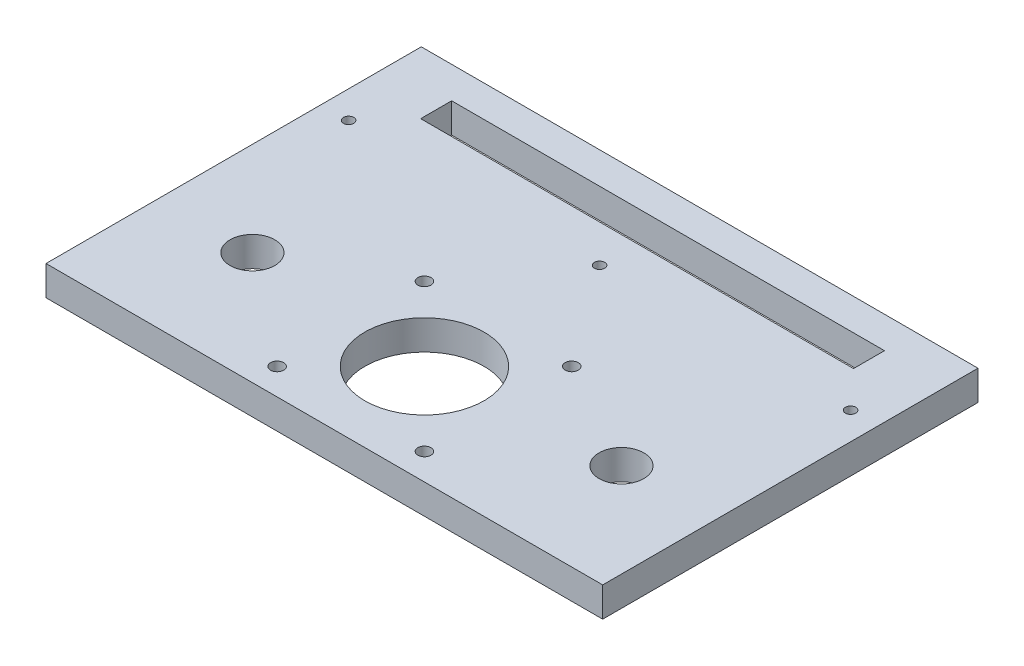
ISO-10303-21;
HEADER;
FILE_DESCRIPTION(('STEP AP214'),'2;1');
FILE_NAME('part.step','',(''),(''),'','','');
FILE_SCHEMA(('AUTOMOTIVE_DESIGN { 1 0 10303 214 1 1 1 1 }'));
ENDSEC;
DATA;
#1=APPLICATION_CONTEXT('core data for automotive mechanical design processes');
#2=APPLICATION_PROTOCOL_DEFINITION('international standard','automotive_design',2000,#1);
#3=PRODUCT_CONTEXT('',#1,'mechanical');
#4=PRODUCT('Part','Part','',(#3));
#5=PRODUCT_RELATED_PRODUCT_CATEGORY('part','',(#4));
#6=PRODUCT_DEFINITION_FORMATION('','',#4);
#7=PRODUCT_DEFINITION_CONTEXT('part definition',#1,'design');
#8=PRODUCT_DEFINITION('design','',#6,#7);
#9=PRODUCT_DEFINITION_SHAPE('','',#8);
#10=(LENGTH_UNIT() NAMED_UNIT(*) SI_UNIT(.MILLI.,.METRE.));
#11=(NAMED_UNIT(*) PLANE_ANGLE_UNIT() SI_UNIT($,.RADIAN.));
#12=(NAMED_UNIT(*) SI_UNIT($,.STERADIAN.) SOLID_ANGLE_UNIT());
#13=UNCERTAINTY_MEASURE_WITH_UNIT(LENGTH_MEASURE(1.E-05),#10,'distance_accuracy_value','');
#14=(GEOMETRIC_REPRESENTATION_CONTEXT(3) GLOBAL_UNCERTAINTY_ASSIGNED_CONTEXT((#13)) GLOBAL_UNIT_ASSIGNED_CONTEXT((#10,
#11,#12)) REPRESENTATION_CONTEXT('',''));
#15=CARTESIAN_POINT('',(0.,0.,0.));
#16=DIRECTION('',(0.,0.,1.));
#17=DIRECTION('',(1.,0.,0.));
#18=AXIS2_PLACEMENT_3D('',#15,#16,#17);
#19=CARTESIAN_POINT('',(0.,9.5,0.));
#20=DIRECTION('',(0.,1.,0.));
#21=DIRECTION('',(0.,0.,1.));
#22=AXIS2_PLACEMENT_3D('',#19,#20,#21);
#23=PLANE('',#22);
#24=CARTESIAN_POINT('',(-23.55,9.5,4.45));
#25=DIRECTION('',(0.,1.,0.));
#26=DIRECTION('',(0.,0.,1.));
#27=AXIS2_PLACEMENT_3D('',#24,#25,#26);
#28=CIRCLE('',#27,2.1);
#29=CARTESIAN_POINT('',(-23.55,9.5,6.55));
#30=VERTEX_POINT('',#29);
#31=EDGE_CURVE('E297',#30,#30,#28,.T.);
#32=ORIENTED_EDGE('',*,*,#31,.F.);
#33=EDGE_LOOP('',(#32));
#34=FACE_BOUND('',#33,.T.);
#35=CARTESIAN_POINT('',(23.55,9.5,4.45));
#36=DIRECTION('',(0.,1.,0.));
#37=DIRECTION('',(0.,0.,1.));
#38=AXIS2_PLACEMENT_3D('',#35,#36,#37);
#39=CIRCLE('',#38,2.1);
#40=CARTESIAN_POINT('',(23.55,9.5,6.55));
#41=VERTEX_POINT('',#40);
#42=EDGE_CURVE('E301',#41,#41,#39,.T.);
#43=ORIENTED_EDGE('',*,*,#42,.F.);
#44=EDGE_LOOP('',(#43));
#45=FACE_BOUND('',#44,.T.);
#46=CARTESIAN_POINT('',(23.5500000000005,9.5,51.55));
#47=DIRECTION('',(0.,1.,0.));
#48=DIRECTION('',(0.,0.,1.));
#49=AXIS2_PLACEMENT_3D('',#46,#47,#48);
#50=CIRCLE('',#49,2.1);
#51=CARTESIAN_POINT('',(23.5500000000005,9.5,53.65));
#52=VERTEX_POINT('',#51);
#53=EDGE_CURVE('E311',#52,#52,#50,.T.);
#54=ORIENTED_EDGE('',*,*,#53,.F.);
#55=EDGE_LOOP('',(#54));
#56=FACE_BOUND('',#55,.T.);
#57=CARTESIAN_POINT('',(-23.5499999999995,9.5,51.55));
#58=DIRECTION('',(0.,1.,0.));
#59=DIRECTION('',(0.,0.,1.));
#60=AXIS2_PLACEMENT_3D('',#57,#58,#59);
#61=CIRCLE('',#60,2.1);
#62=CARTESIAN_POINT('',(-23.5499999999995,9.5,53.65));
#63=VERTEX_POINT('',#62);
#64=EDGE_CURVE('E319',#63,#63,#61,.T.);
#65=ORIENTED_EDGE('',*,*,#64,.F.);
#66=EDGE_LOOP('',(#65));
#67=FACE_BOUND('',#66,.T.);
#68=CARTESIAN_POINT('',(-80.25,9.5,-28.));
#69=DIRECTION('',(0.,1.,0.));
#70=DIRECTION('',(0.,0.,1.));
#71=AXIS2_PLACEMENT_3D('',#68,#69,#70);
#72=CIRCLE('',#71,1.64999999999998);
#73=CARTESIAN_POINT('',(-80.25,9.5,-26.35));
#74=VERTEX_POINT('',#73);
#75=EDGE_CURVE('E327',#74,#74,#72,.T.);
#76=ORIENTED_EDGE('',*,*,#75,.F.);
#77=EDGE_LOOP('',(#76));
#78=FACE_BOUND('',#77,.T.);
#79=CARTESIAN_POINT('',(0.,9.5,-28.));
#80=DIRECTION('',(0.,1.,0.));
#81=DIRECTION('',(0.,0.,1.));
#82=AXIS2_PLACEMENT_3D('',#79,#80,#81);
#83=CIRCLE('',#82,1.64999999999999);
#84=CARTESIAN_POINT('',(0.,9.5,-26.35));
#85=VERTEX_POINT('',#84);
#86=EDGE_CURVE('E335',#85,#85,#83,.T.);
#87=ORIENTED_EDGE('',*,*,#86,.F.);
#88=EDGE_LOOP('',(#87));
#89=FACE_BOUND('',#88,.T.);
#90=CARTESIAN_POINT('',(80.25,9.5,-28.));
#91=DIRECTION('',(0.,1.,0.));
#92=DIRECTION('',(0.,0.,1.));
#93=AXIS2_PLACEMENT_3D('',#90,#91,#92);
#94=CIRCLE('',#93,1.64999999999998);
#95=CARTESIAN_POINT('',(80.25,9.5,-26.3500000000001));
#96=VERTEX_POINT('',#95);
#97=EDGE_CURVE('E343',#96,#96,#94,.T.);
#98=ORIENTED_EDGE('',*,*,#97,.F.);
#99=EDGE_LOOP('',(#98));
#100=FACE_BOUND('',#99,.T.);
#101=CARTESIAN_POINT('',(-59.,9.5,24.));
#102=DIRECTION('',(0.,1.,0.));
#103=DIRECTION('',(0.,0.,1.));
#104=AXIS2_PLACEMENT_3D('',#101,#102,#103);
#105=CIRCLE('',#104,7.15);
#106=CARTESIAN_POINT('',(-59.,9.5,31.15));
#107=VERTEX_POINT('',#106);
#108=EDGE_CURVE('E360',#107,#107,#105,.T.);
#109=ORIENTED_EDGE('',*,*,#108,.F.);
#110=EDGE_LOOP('',(#109));
#111=FACE_BOUND('',#110,.T.);
#112=DIRECTION('',(0.,0.,1.));
#113=VECTOR('',#112,1.);
#114=CARTESIAN_POINT('',(-69.2,9.5,-49.9));
#115=LINE('',#114,#113);
#116=CARTESIAN_POINT('',(-69.2,9.5,-49.9));
#117=VERTEX_POINT('',#116);
#118=CARTESIAN_POINT('',(-69.2,9.5,-40.));
#119=VERTEX_POINT('',#118);
#120=EDGE_CURVE('E118',#117,#119,#115,.T.);
#121=ORIENTED_EDGE('',*,*,#120,.F.);
#122=DIRECTION('',(-1.,0.,0.));
#123=VECTOR('',#122,1.);
#124=CARTESIAN_POINT('',(69.2,9.5,-49.9));
#125=LINE('',#124,#123);
#126=CARTESIAN_POINT('',(69.2,9.5,-49.9));
#127=VERTEX_POINT('',#126);
#128=EDGE_CURVE('E109',#127,#117,#125,.T.);
#129=ORIENTED_EDGE('',*,*,#128,.F.);
#130=DIRECTION('',(0.,0.,-1.));
#131=VECTOR('',#130,1.);
#132=CARTESIAN_POINT('',(69.2,9.5,-40.));
#133=LINE('',#132,#131);
#134=CARTESIAN_POINT('',(69.2,9.5,-40.));
#135=VERTEX_POINT('',#134);
#136=EDGE_CURVE('E136',#135,#127,#133,.T.);
#137=ORIENTED_EDGE('',*,*,#136,.F.);
#138=DIRECTION('',(1.,0.,0.));
#139=VECTOR('',#138,1.);
#140=CARTESIAN_POINT('',(-69.2,9.5,-40.));
#141=LINE('',#140,#139);
#142=EDGE_CURVE('E132',#119,#135,#141,.T.);
#143=ORIENTED_EDGE('',*,*,#142,.F.);
#144=EDGE_LOOP('',(#121,#129,#137,#143));
#145=FACE_BOUND('',#144,.T.);
#146=DIRECTION('',(0.,0.,-1.));
#147=VECTOR('',#146,1.);
#148=CARTESIAN_POINT('',(89.,9.5,-60.));
#149=LINE('',#148,#147);
#150=CARTESIAN_POINT('',(89.,9.5,60.));
#151=VERTEX_POINT('',#150);
#152=CARTESIAN_POINT('',(89.,9.5,-60.));
#153=VERTEX_POINT('',#152);
#154=EDGE_CURVE('E160',#151,#153,#149,.T.);
#155=ORIENTED_EDGE('',*,*,#154,.T.);
#156=DIRECTION('',(-1.,0.,0.));
#157=VECTOR('',#156,1.);
#158=CARTESIAN_POINT('',(-89.,9.5,-60.));
#159=LINE('',#158,#157);
#160=CARTESIAN_POINT('',(-89.,9.5,-60.));
#161=VERTEX_POINT('',#160);
#162=EDGE_CURVE('E164',#153,#161,#159,.T.);
#163=ORIENTED_EDGE('',*,*,#162,.T.);
#164=DIRECTION('',(0.,0.,1.));
#165=VECTOR('',#164,1.);
#166=CARTESIAN_POINT('',(-89.,9.5,-60.));
#167=LINE('',#166,#165);
#168=CARTESIAN_POINT('',(-89.,9.5,60.));
#169=VERTEX_POINT('',#168);
#170=EDGE_CURVE('E168',#161,#169,#167,.T.);
#171=ORIENTED_EDGE('',*,*,#170,.T.);
#172=DIRECTION('',(1.,0.,0.));
#173=VECTOR('',#172,1.);
#174=CARTESIAN_POINT('',(-89.,9.5,60.));
#175=LINE('',#174,#173);
#176=EDGE_CURVE('E171',#169,#151,#175,.T.);
#177=ORIENTED_EDGE('',*,*,#176,.T.);
#178=EDGE_LOOP('',(#155,#163,#171,#177));
#179=FACE_BOUND('',#178,.T.);
#180=CARTESIAN_POINT('',(0.,9.5,28.));
#181=DIRECTION('',(0.,1.,0.));
#182=DIRECTION('',(0.,0.,1.));
#183=AXIS2_PLACEMENT_3D('',#180,#181,#182);
#184=CIRCLE('',#183,19.0500000000001);
#185=CARTESIAN_POINT('',(0.,9.5,47.0500000000001));
#186=VERTEX_POINT('',#185);
#187=EDGE_CURVE('E144',#186,#186,#184,.T.);
#188=ORIENTED_EDGE('',*,*,#187,.F.);
#189=EDGE_LOOP('',(#188));
#190=FACE_BOUND('',#189,.T.);
#191=CARTESIAN_POINT('',(59.,9.5,24.));
#192=DIRECTION('',(0.,1.,0.));
#193=DIRECTION('',(0.,0.,-1.));
#194=AXIS2_PLACEMENT_3D('',#191,#192,#193);
#195=CIRCLE('',#194,7.15);
#196=CARTESIAN_POINT('',(59.,9.5,16.85));
#197=VERTEX_POINT('',#196);
#198=EDGE_CURVE('E352',#197,#197,#195,.T.);
#199=ORIENTED_EDGE('',*,*,#198,.F.);
#200=EDGE_LOOP('',(#199));
#201=FACE_BOUND('',#200,.T.);
#202=ADVANCED_FACE('F43',(#34,#45,#56,#67,#78,#89,#100,#111,#145,#179,#190,#201),#23,.T.);
#203=CARTESIAN_POINT('',(0.,0.,0.));
#204=DIRECTION('',(0.,1.,0.));
#205=DIRECTION('',(0.,0.,1.));
#206=AXIS2_PLACEMENT_3D('',#203,#204,#205);
#207=PLANE('',#206);
#208=CARTESIAN_POINT('',(-23.55,0.,4.45));
#209=DIRECTION('',(0.,1.,0.));
#210=DIRECTION('',(0.,0.,1.));
#211=AXIS2_PLACEMENT_3D('',#208,#209,#210);
#212=CIRCLE('',#211,2.1);
#213=CARTESIAN_POINT('',(-23.55,0.,6.55));
#214=VERTEX_POINT('',#213);
#215=EDGE_CURVE('E295',#214,#214,#212,.T.);
#216=ORIENTED_EDGE('',*,*,#215,.T.);
#217=EDGE_LOOP('',(#216));
#218=FACE_BOUND('',#217,.T.);
#219=CARTESIAN_POINT('',(23.55,0.,4.45));
#220=DIRECTION('',(0.,1.,0.));
#221=DIRECTION('',(0.,0.,1.));
#222=AXIS2_PLACEMENT_3D('',#219,#220,#221);
#223=CIRCLE('',#222,2.1);
#224=CARTESIAN_POINT('',(23.55,0.,6.55));
#225=VERTEX_POINT('',#224);
#226=EDGE_CURVE('E307',#225,#225,#223,.T.);
#227=ORIENTED_EDGE('',*,*,#226,.T.);
#228=EDGE_LOOP('',(#227));
#229=FACE_BOUND('',#228,.T.);
#230=CARTESIAN_POINT('',(23.5500000000005,0.,51.55));
#231=DIRECTION('',(0.,1.,0.));
#232=DIRECTION('',(0.,0.,1.));
#233=AXIS2_PLACEMENT_3D('',#230,#231,#232);
#234=CIRCLE('',#233,2.1);
#235=CARTESIAN_POINT('',(23.5500000000005,0.,53.65));
#236=VERTEX_POINT('',#235);
#237=EDGE_CURVE('E315',#236,#236,#234,.T.);
#238=ORIENTED_EDGE('',*,*,#237,.T.);
#239=EDGE_LOOP('',(#238));
#240=FACE_BOUND('',#239,.T.);
#241=CARTESIAN_POINT('',(-23.5499999999995,0.,51.55));
#242=DIRECTION('',(0.,1.,0.));
#243=DIRECTION('',(0.,0.,1.));
#244=AXIS2_PLACEMENT_3D('',#241,#242,#243);
#245=CIRCLE('',#244,2.1);
#246=CARTESIAN_POINT('',(-23.5499999999995,0.,53.65));
#247=VERTEX_POINT('',#246);
#248=EDGE_CURVE('E323',#247,#247,#245,.T.);
#249=ORIENTED_EDGE('',*,*,#248,.T.);
#250=EDGE_LOOP('',(#249));
#251=FACE_BOUND('',#250,.T.);
#252=CARTESIAN_POINT('',(-80.25,0.,-28.));
#253=DIRECTION('',(0.,1.,0.));
#254=DIRECTION('',(0.,0.,1.));
#255=AXIS2_PLACEMENT_3D('',#252,#253,#254);
#256=CIRCLE('',#255,1.65);
#257=CARTESIAN_POINT('',(-80.25,0.,-26.35));
#258=VERTEX_POINT('',#257);
#259=EDGE_CURVE('E331',#258,#258,#256,.T.);
#260=ORIENTED_EDGE('',*,*,#259,.T.);
#261=EDGE_LOOP('',(#260));
#262=FACE_BOUND('',#261,.T.);
#263=CARTESIAN_POINT('',(0.,0.,-28.));
#264=DIRECTION('',(0.,1.,0.));
#265=DIRECTION('',(0.,0.,1.));
#266=AXIS2_PLACEMENT_3D('',#263,#264,#265);
#267=CIRCLE('',#266,1.65);
#268=CARTESIAN_POINT('',(0.,0.,-26.35));
#269=VERTEX_POINT('',#268);
#270=EDGE_CURVE('E339',#269,#269,#267,.T.);
#271=ORIENTED_EDGE('',*,*,#270,.T.);
#272=EDGE_LOOP('',(#271));
#273=FACE_BOUND('',#272,.T.);
#274=CARTESIAN_POINT('',(80.25,0.,-28.));
#275=DIRECTION('',(0.,1.,0.));
#276=DIRECTION('',(0.,0.,1.));
#277=AXIS2_PLACEMENT_3D('',#274,#275,#276);
#278=CIRCLE('',#277,1.65);
#279=CARTESIAN_POINT('',(80.25,0.,-26.35));
#280=VERTEX_POINT('',#279);
#281=EDGE_CURVE('E347',#280,#280,#278,.T.);
#282=ORIENTED_EDGE('',*,*,#281,.T.);
#283=EDGE_LOOP('',(#282));
#284=FACE_BOUND('',#283,.T.);
#285=DIRECTION('',(0.,0.,-1.));
#286=VECTOR('',#285,1.);
#287=CARTESIAN_POINT('',(89.,0.,-60.));
#288=LINE('',#287,#286);
#289=CARTESIAN_POINT('',(89.,0.,60.));
#290=VERTEX_POINT('',#289);
#291=CARTESIAN_POINT('',(89.,0.,-60.));
#292=VERTEX_POINT('',#291);
#293=EDGE_CURVE('E127',#290,#292,#288,.T.);
#294=ORIENTED_EDGE('',*,*,#293,.F.);
#295=DIRECTION('',(1.,0.,0.));
#296=VECTOR('',#295,1.);
#297=CARTESIAN_POINT('',(-89.,0.,60.));
#298=LINE('',#297,#296);
#299=CARTESIAN_POINT('',(-89.,0.,60.));
#300=VERTEX_POINT('',#299);
#301=EDGE_CURVE('E165',#300,#290,#298,.T.);
#302=ORIENTED_EDGE('',*,*,#301,.F.);
#303=DIRECTION('',(0.,0.,1.));
#304=VECTOR('',#303,1.);
#305=CARTESIAN_POINT('',(-89.,0.,-60.));
#306=LINE('',#305,#304);
#307=CARTESIAN_POINT('',(-89.,0.,-60.));
#308=VERTEX_POINT('',#307);
#309=EDGE_CURVE('E181',#308,#300,#306,.T.);
#310=ORIENTED_EDGE('',*,*,#309,.F.);
#311=DIRECTION('',(-1.,0.,0.));
#312=VECTOR('',#311,1.);
#313=CARTESIAN_POINT('',(-89.,0.,-60.));
#314=LINE('',#313,#312);
#315=EDGE_CURVE('E178',#292,#308,#314,.T.);
#316=ORIENTED_EDGE('',*,*,#315,.F.);
#317=EDGE_LOOP('',(#294,#302,#310,#316));
#318=FACE_BOUND('',#317,.T.);
#319=DIRECTION('',(-1.,0.,0.));
#320=VECTOR('',#319,1.);
#321=CARTESIAN_POINT('',(69.2,0.,-49.9));
#322=LINE('',#321,#320);
#323=CARTESIAN_POINT('',(69.2,0.,-49.9));
#324=VERTEX_POINT('',#323);
#325=CARTESIAN_POINT('',(-69.2,0.,-49.9));
#326=VERTEX_POINT('',#325);
#327=EDGE_CURVE('E67',#324,#326,#322,.T.);
#328=ORIENTED_EDGE('',*,*,#327,.T.);
#329=DIRECTION('',(0.,0.,1.));
#330=VECTOR('',#329,1.);
#331=CARTESIAN_POINT('',(-69.2,0.,-49.9));
#332=LINE('',#331,#330);
#333=CARTESIAN_POINT('',(-69.2,0.,-40.));
#334=VERTEX_POINT('',#333);
#335=EDGE_CURVE('E125',#326,#334,#332,.T.);
#336=ORIENTED_EDGE('',*,*,#335,.T.);
#337=DIRECTION('',(1.,0.,0.));
#338=VECTOR('',#337,1.);
#339=CARTESIAN_POINT('',(-69.2,0.,-40.));
#340=LINE('',#339,#338);
#341=CARTESIAN_POINT('',(69.2,0.,-40.));
#342=VERTEX_POINT('',#341);
#343=EDGE_CURVE('E147',#334,#342,#340,.T.);
#344=ORIENTED_EDGE('',*,*,#343,.T.);
#345=DIRECTION('',(0.,0.,-1.));
#346=VECTOR('',#345,1.);
#347=CARTESIAN_POINT('',(69.2,0.,-40.));
#348=LINE('',#347,#346);
#349=EDGE_CURVE('E119',#342,#324,#348,.T.);
#350=ORIENTED_EDGE('',*,*,#349,.T.);
#351=EDGE_LOOP('',(#328,#336,#344,#350));
#352=FACE_BOUND('',#351,.T.);
#353=CARTESIAN_POINT('',(0.,0.,28.));
#354=DIRECTION('',(0.,1.,0.));
#355=DIRECTION('',(0.,0.,1.));
#356=AXIS2_PLACEMENT_3D('',#353,#354,#355);
#357=CIRCLE('',#356,19.0500000000001);
#358=CARTESIAN_POINT('',(0.,0.,47.0500000000001));
#359=VERTEX_POINT('',#358);
#360=EDGE_CURVE('E364',#359,#359,#357,.T.);
#361=ORIENTED_EDGE('',*,*,#360,.T.);
#362=EDGE_LOOP('',(#361));
#363=FACE_BOUND('',#362,.T.);
#364=CARTESIAN_POINT('',(-59.,0.,24.));
#365=DIRECTION('',(0.,1.,0.));
#366=DIRECTION('',(0.,0.,1.));
#367=AXIS2_PLACEMENT_3D('',#364,#365,#366);
#368=CIRCLE('',#367,7.15);
#369=CARTESIAN_POINT('',(-59.,0.,31.15));
#370=VERTEX_POINT('',#369);
#371=EDGE_CURVE('E356',#370,#370,#368,.T.);
#372=ORIENTED_EDGE('',*,*,#371,.T.);
#373=EDGE_LOOP('',(#372));
#374=FACE_BOUND('',#373,.T.);
#375=CARTESIAN_POINT('',(59.,0.,24.));
#376=DIRECTION('',(0.,1.,0.));
#377=DIRECTION('',(0.,0.,-1.));
#378=AXIS2_PLACEMENT_3D('',#375,#376,#377);
#379=CIRCLE('',#378,7.15);
#380=CARTESIAN_POINT('',(59.,0.,16.85));
#381=VERTEX_POINT('',#380);
#382=EDGE_CURVE('E351',#381,#381,#379,.T.);
#383=ORIENTED_EDGE('',*,*,#382,.T.);
#384=EDGE_LOOP('',(#383));
#385=FACE_BOUND('',#384,.T.);
#386=ADVANCED_FACE('F204',(#218,#229,#240,#251,#262,#273,#284,#318,#352,#363,#374,#385),#207,.F.);
#387=CARTESIAN_POINT('',(89.,9.5,-60.));
#388=DIRECTION('',(-1.,0.,0.));
#389=DIRECTION('',(0.,0.,1.));
#390=AXIS2_PLACEMENT_3D('',#387,#388,#389);
#391=PLANE('',#390);
#392=ORIENTED_EDGE('',*,*,#293,.T.);
#393=DIRECTION('',(0.,-1.,0.));
#394=VECTOR('',#393,1.);
#395=CARTESIAN_POINT('',(89.,9.5,-60.));
#396=LINE('',#395,#394);
#397=EDGE_CURVE('E11',#153,#292,#396,.T.);
#398=ORIENTED_EDGE('',*,*,#397,.F.);
#399=ORIENTED_EDGE('',*,*,#154,.F.);
#400=DIRECTION('',(0.,-1.,0.));
#401=VECTOR('',#400,1.);
#402=CARTESIAN_POINT('',(89.,9.5,60.));
#403=LINE('',#402,#401);
#404=EDGE_CURVE('E174',#151,#290,#403,.T.);
#405=ORIENTED_EDGE('',*,*,#404,.T.);
#406=EDGE_LOOP('',(#392,#398,#399,#405));
#407=FACE_BOUND('',#406,.T.);
#408=ADVANCED_FACE('F45',(#407),#391,.F.);
#409=CARTESIAN_POINT('',(-89.,9.5,-60.));
#410=DIRECTION('',(0.,0.,1.));
#411=DIRECTION('',(1.,0.,0.));
#412=AXIS2_PLACEMENT_3D('',#409,#410,#411);
#413=PLANE('',#412);
#414=ORIENTED_EDGE('',*,*,#315,.T.);
#415=DIRECTION('',(0.,-1.,0.));
#416=VECTOR('',#415,1.);
#417=CARTESIAN_POINT('',(-89.,9.5,-60.));
#418=LINE('',#417,#416);
#419=EDGE_CURVE('E52',#161,#308,#418,.T.);
#420=ORIENTED_EDGE('',*,*,#419,.F.);
#421=ORIENTED_EDGE('',*,*,#162,.F.);
#422=ORIENTED_EDGE('',*,*,#397,.T.);
#423=EDGE_LOOP('',(#414,#420,#421,#422));
#424=FACE_BOUND('',#423,.T.);
#425=ADVANCED_FACE('F214',(#424),#413,.F.);
#426=CARTESIAN_POINT('',(-89.,9.5,-60.));
#427=DIRECTION('',(1.,0.,0.));
#428=DIRECTION('',(0.,0.,-1.));
#429=AXIS2_PLACEMENT_3D('',#426,#427,#428);
#430=PLANE('',#429);
#431=ORIENTED_EDGE('',*,*,#309,.T.);
#432=DIRECTION('',(0.,-1.,0.));
#433=VECTOR('',#432,1.);
#434=CARTESIAN_POINT('',(-89.,9.5,60.));
#435=LINE('',#434,#433);
#436=EDGE_CURVE('E189',#169,#300,#435,.T.);
#437=ORIENTED_EDGE('',*,*,#436,.F.);
#438=ORIENTED_EDGE('',*,*,#170,.F.);
#439=ORIENTED_EDGE('',*,*,#419,.T.);
#440=EDGE_LOOP('',(#431,#437,#438,#439));
#441=FACE_BOUND('',#440,.T.);
#442=ADVANCED_FACE('F198',(#441),#430,.F.);
#443=CARTESIAN_POINT('',(-89.,9.5,60.));
#444=DIRECTION('',(0.,0.,-1.));
#445=DIRECTION('',(-1.,0.,0.));
#446=AXIS2_PLACEMENT_3D('',#443,#444,#445);
#447=PLANE('',#446);
#448=ORIENTED_EDGE('',*,*,#301,.T.);
#449=ORIENTED_EDGE('',*,*,#404,.F.);
#450=ORIENTED_EDGE('',*,*,#176,.F.);
#451=ORIENTED_EDGE('',*,*,#436,.T.);
#452=EDGE_LOOP('',(#448,#449,#450,#451));
#453=FACE_BOUND('',#452,.T.);
#454=ADVANCED_FACE('F208',(#453),#447,.F.);
#455=CARTESIAN_POINT('',(69.2,9.5,-49.9));
#456=DIRECTION('',(0.,0.,1.));
#457=DIRECTION('',(1.,0.,0.));
#458=AXIS2_PLACEMENT_3D('',#455,#456,#457);
#459=PLANE('',#458);
#460=ORIENTED_EDGE('',*,*,#327,.F.);
#461=DIRECTION('',(0.,-1.,0.));
#462=VECTOR('',#461,1.);
#463=CARTESIAN_POINT('',(69.2,9.5,-49.9));
#464=LINE('',#463,#462);
#465=EDGE_CURVE('E113',#127,#324,#464,.T.);
#466=ORIENTED_EDGE('',*,*,#465,.F.);
#467=ORIENTED_EDGE('',*,*,#128,.T.);
#468=DIRECTION('',(0.,-1.,0.));
#469=VECTOR('',#468,1.);
#470=CARTESIAN_POINT('',(-69.2,9.5,-49.9));
#471=LINE('',#470,#469);
#472=EDGE_CURVE('E112',#117,#326,#471,.T.);
#473=ORIENTED_EDGE('',*,*,#472,.T.);
#474=EDGE_LOOP('',(#460,#466,#467,#473));
#475=FACE_BOUND('',#474,.T.);
#476=ADVANCED_FACE('F111',(#475),#459,.T.);
#477=CARTESIAN_POINT('',(-69.2,9.5,-49.9));
#478=DIRECTION('',(1.,0.,0.));
#479=DIRECTION('',(0.,0.,-1.));
#480=AXIS2_PLACEMENT_3D('',#477,#478,#479);
#481=PLANE('',#480);
#482=ORIENTED_EDGE('',*,*,#335,.F.);
#483=ORIENTED_EDGE('',*,*,#472,.F.);
#484=ORIENTED_EDGE('',*,*,#120,.T.);
#485=DIRECTION('',(0.,-1.,0.));
#486=VECTOR('',#485,1.);
#487=CARTESIAN_POINT('',(-69.2,9.5,-40.));
#488=LINE('',#487,#486);
#489=EDGE_CURVE('E128',#119,#334,#488,.T.);
#490=ORIENTED_EDGE('',*,*,#489,.T.);
#491=EDGE_LOOP('',(#482,#483,#484,#490));
#492=FACE_BOUND('',#491,.T.);
#493=ADVANCED_FACE('F122',(#492),#481,.T.);
#494=CARTESIAN_POINT('',(-69.2,9.5,-40.));
#495=DIRECTION('',(0.,0.,-1.));
#496=DIRECTION('',(-1.,0.,0.));
#497=AXIS2_PLACEMENT_3D('',#494,#495,#496);
#498=PLANE('',#497);
#499=ORIENTED_EDGE('',*,*,#343,.F.);
#500=ORIENTED_EDGE('',*,*,#489,.F.);
#501=ORIENTED_EDGE('',*,*,#142,.T.);
#502=DIRECTION('',(0.,-1.,0.));
#503=VECTOR('',#502,1.);
#504=CARTESIAN_POINT('',(69.2,9.5,-40.));
#505=LINE('',#504,#503);
#506=EDGE_CURVE('E59',#135,#342,#505,.T.);
#507=ORIENTED_EDGE('',*,*,#506,.T.);
#508=EDGE_LOOP('',(#499,#500,#501,#507));
#509=FACE_BOUND('',#508,.T.);
#510=ADVANCED_FACE('F241',(#509),#498,.T.);
#511=CARTESIAN_POINT('',(69.2,9.5,-40.));
#512=DIRECTION('',(-1.,0.,0.));
#513=DIRECTION('',(0.,0.,1.));
#514=AXIS2_PLACEMENT_3D('',#511,#512,#513);
#515=PLANE('',#514);
#516=ORIENTED_EDGE('',*,*,#349,.F.);
#517=ORIENTED_EDGE('',*,*,#506,.F.);
#518=ORIENTED_EDGE('',*,*,#136,.T.);
#519=ORIENTED_EDGE('',*,*,#465,.T.);
#520=EDGE_LOOP('',(#516,#517,#518,#519));
#521=FACE_BOUND('',#520,.T.);
#522=ADVANCED_FACE('F245',(#521),#515,.T.);
#523=CARTESIAN_POINT('',(0.,9.5,28.));
#524=DIRECTION('',(0.,-1.,0.));
#525=DIRECTION('',(0.,0.,-1.));
#526=AXIS2_PLACEMENT_3D('',#523,#524,#525);
#527=CYLINDRICAL_SURFACE('',#526,19.0500000000001);
#528=ORIENTED_EDGE('',*,*,#187,.T.);
#529=EDGE_LOOP('',(#528));
#530=FACE_BOUND('',#529,.T.);
#531=ORIENTED_EDGE('',*,*,#360,.F.);
#532=EDGE_LOOP('',(#531));
#533=FACE_BOUND('',#532,.T.);
#534=ADVANCED_FACE('F251',(#530,#533),#527,.F.);
#535=CARTESIAN_POINT('',(-59.,9.5,24.));
#536=DIRECTION('',(0.,-1.,0.));
#537=DIRECTION('',(0.,0.,-1.));
#538=AXIS2_PLACEMENT_3D('',#535,#536,#537);
#539=CYLINDRICAL_SURFACE('',#538,7.15);
#540=ORIENTED_EDGE('',*,*,#108,.T.);
#541=EDGE_LOOP('',(#540));
#542=FACE_BOUND('',#541,.T.);
#543=ORIENTED_EDGE('',*,*,#371,.F.);
#544=EDGE_LOOP('',(#543));
#545=FACE_BOUND('',#544,.T.);
#546=ADVANCED_FACE('F254',(#542,#545),#539,.F.);
#547=CARTESIAN_POINT('',(59.,9.5,24.));
#548=DIRECTION('',(0.,-1.,0.));
#549=DIRECTION('',(0.,0.,-1.));
#550=AXIS2_PLACEMENT_3D('',#547,#548,#549);
#551=CYLINDRICAL_SURFACE('',#550,7.15);
#552=ORIENTED_EDGE('',*,*,#198,.T.);
#553=EDGE_LOOP('',(#552));
#554=FACE_BOUND('',#553,.T.);
#555=ORIENTED_EDGE('',*,*,#382,.F.);
#556=EDGE_LOOP('',(#555));
#557=FACE_BOUND('',#556,.T.);
#558=ADVANCED_FACE('F258',(#554,#557),#551,.F.);
#559=CARTESIAN_POINT('',(80.25,9.5,-28.));
#560=DIRECTION('',(0.,1.,0.));
#561=DIRECTION('',(0.,0.,1.));
#562=AXIS2_PLACEMENT_3D('',#559,#560,#561);
#563=CYLINDRICAL_SURFACE('',#562,1.64999999999999);
#564=ORIENTED_EDGE('',*,*,#281,.F.);
#565=EDGE_LOOP('',(#564));
#566=FACE_BOUND('',#565,.T.);
#567=ORIENTED_EDGE('',*,*,#97,.T.);
#568=EDGE_LOOP('',(#567));
#569=FACE_BOUND('',#568,.T.);
#570=ADVANCED_FACE('F262',(#566,#569),#563,.F.);
#571=CARTESIAN_POINT('',(0.,9.5,-28.));
#572=DIRECTION('',(0.,1.,0.));
#573=DIRECTION('',(0.,0.,1.));
#574=AXIS2_PLACEMENT_3D('',#571,#572,#573);
#575=CYLINDRICAL_SURFACE('',#574,1.64999999999999);
#576=ORIENTED_EDGE('',*,*,#270,.F.);
#577=EDGE_LOOP('',(#576));
#578=FACE_BOUND('',#577,.T.);
#579=ORIENTED_EDGE('',*,*,#86,.T.);
#580=EDGE_LOOP('',(#579));
#581=FACE_BOUND('',#580,.T.);
#582=ADVANCED_FACE('F266',(#578,#581),#575,.F.);
#583=CARTESIAN_POINT('',(-80.25,9.5,-28.));
#584=DIRECTION('',(0.,1.,0.));
#585=DIRECTION('',(0.,0.,1.));
#586=AXIS2_PLACEMENT_3D('',#583,#584,#585);
#587=CYLINDRICAL_SURFACE('',#586,1.64999999999999);
#588=ORIENTED_EDGE('',*,*,#259,.F.);
#589=EDGE_LOOP('',(#588));
#590=FACE_BOUND('',#589,.T.);
#591=ORIENTED_EDGE('',*,*,#75,.T.);
#592=EDGE_LOOP('',(#591));
#593=FACE_BOUND('',#592,.T.);
#594=ADVANCED_FACE('F270',(#590,#593),#587,.F.);
#595=CARTESIAN_POINT('',(-23.5499999999995,9.5,51.55));
#596=DIRECTION('',(0.,1.,0.));
#597=DIRECTION('',(0.,0.,1.));
#598=AXIS2_PLACEMENT_3D('',#595,#596,#597);
#599=CYLINDRICAL_SURFACE('',#598,2.1);
#600=ORIENTED_EDGE('',*,*,#248,.F.);
#601=EDGE_LOOP('',(#600));
#602=FACE_BOUND('',#601,.T.);
#603=ORIENTED_EDGE('',*,*,#64,.T.);
#604=EDGE_LOOP('',(#603));
#605=FACE_BOUND('',#604,.T.);
#606=ADVANCED_FACE('F274',(#602,#605),#599,.F.);
#607=CARTESIAN_POINT('',(23.5500000000005,9.5,51.55));
#608=DIRECTION('',(0.,1.,0.));
#609=DIRECTION('',(0.,0.,1.));
#610=AXIS2_PLACEMENT_3D('',#607,#608,#609);
#611=CYLINDRICAL_SURFACE('',#610,2.1);
#612=ORIENTED_EDGE('',*,*,#237,.F.);
#613=EDGE_LOOP('',(#612));
#614=FACE_BOUND('',#613,.T.);
#615=ORIENTED_EDGE('',*,*,#53,.T.);
#616=EDGE_LOOP('',(#615));
#617=FACE_BOUND('',#616,.T.);
#618=ADVANCED_FACE('F278',(#614,#617),#611,.F.);
#619=CARTESIAN_POINT('',(23.55,9.5,4.45));
#620=DIRECTION('',(0.,1.,0.));
#621=DIRECTION('',(0.,0.,1.));
#622=AXIS2_PLACEMENT_3D('',#619,#620,#621);
#623=CYLINDRICAL_SURFACE('',#622,2.1);
#624=ORIENTED_EDGE('',*,*,#226,.F.);
#625=EDGE_LOOP('',(#624));
#626=FACE_BOUND('',#625,.T.);
#627=ORIENTED_EDGE('',*,*,#42,.T.);
#628=EDGE_LOOP('',(#627));
#629=FACE_BOUND('',#628,.T.);
#630=ADVANCED_FACE('F282',(#626,#629),#623,.F.);
#631=CARTESIAN_POINT('',(-23.55,9.5,4.45));
#632=DIRECTION('',(0.,1.,0.));
#633=DIRECTION('',(0.,0.,1.));
#634=AXIS2_PLACEMENT_3D('',#631,#632,#633);
#635=CYLINDRICAL_SURFACE('',#634,2.1);
#636=ORIENTED_EDGE('',*,*,#215,.F.);
#637=EDGE_LOOP('',(#636));
#638=FACE_BOUND('',#637,.T.);
#639=ORIENTED_EDGE('',*,*,#31,.T.);
#640=EDGE_LOOP('',(#639));
#641=FACE_BOUND('',#640,.T.);
#642=ADVANCED_FACE('F286',(#638,#641),#635,.F.);
#643=CLOSED_SHELL('',(#202,#386,#408,#425,#442,#454,#476,#493,#510,#522,#534,#546,#558,#570,
#582,#594,#606,#618,#630,#642));
#644=MANIFOLD_SOLID_BREP('B2',#643);
#645=ADVANCED_BREP_SHAPE_REPRESENTATION('',(#18,#644),#14);
#646=SHAPE_DEFINITION_REPRESENTATION(#9,#645);
ENDSEC;
END-ISO-10303-21;
